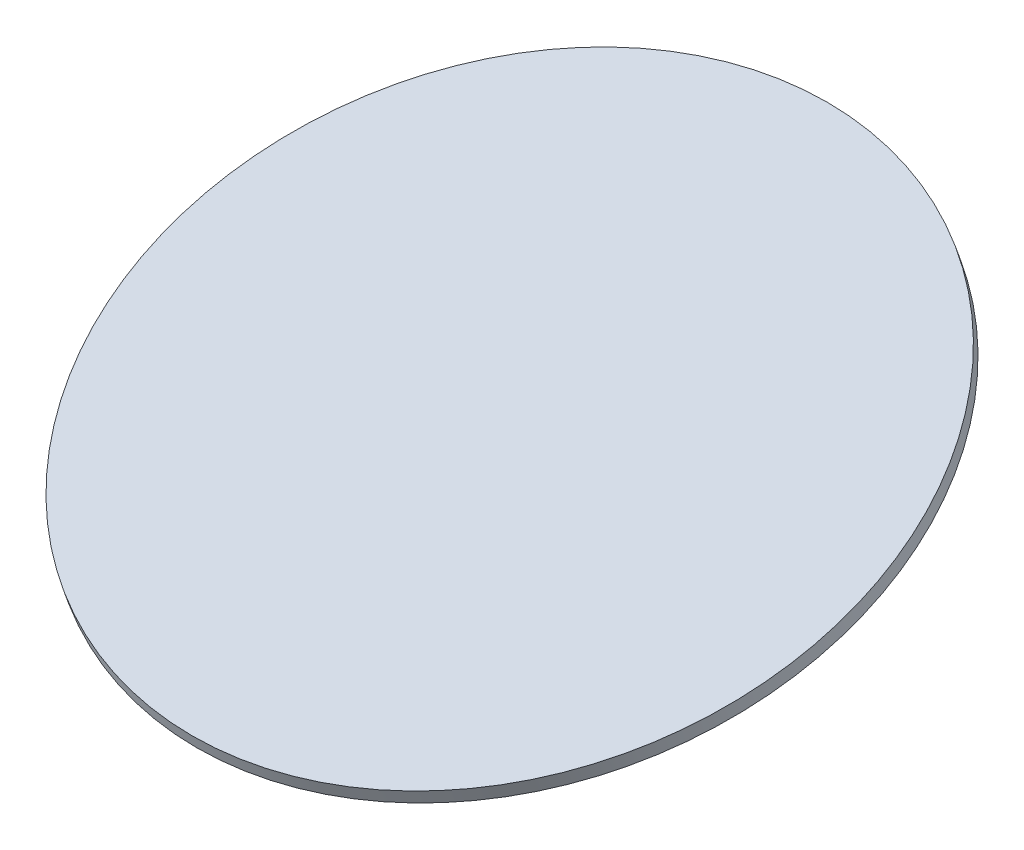
ISO-10303-21;
HEADER;
FILE_DESCRIPTION(('STEP AP214'),'2;1');
FILE_NAME('part.step','',(''),(''),'','','');
FILE_SCHEMA(('AUTOMOTIVE_DESIGN { 1 0 10303 214 1 1 1 1 }'));
ENDSEC;
DATA;
#1=APPLICATION_CONTEXT('core data for automotive mechanical design processes');
#2=APPLICATION_PROTOCOL_DEFINITION('international standard','automotive_design',2000,#1);
#3=PRODUCT_CONTEXT('',#1,'mechanical');
#4=PRODUCT('Part','Part','',(#3));
#5=PRODUCT_RELATED_PRODUCT_CATEGORY('part','',(#4));
#6=PRODUCT_DEFINITION_FORMATION('','',#4);
#7=PRODUCT_DEFINITION_CONTEXT('part definition',#1,'design');
#8=PRODUCT_DEFINITION('design','',#6,#7);
#9=PRODUCT_DEFINITION_SHAPE('','',#8);
#10=(LENGTH_UNIT() NAMED_UNIT(*) SI_UNIT(.MILLI.,.METRE.));
#11=(NAMED_UNIT(*) PLANE_ANGLE_UNIT() SI_UNIT($,.RADIAN.));
#12=(NAMED_UNIT(*) SI_UNIT($,.STERADIAN.) SOLID_ANGLE_UNIT());
#13=UNCERTAINTY_MEASURE_WITH_UNIT(LENGTH_MEASURE(1.E-05),#10,'distance_accuracy_value','');
#14=(GEOMETRIC_REPRESENTATION_CONTEXT(3) GLOBAL_UNCERTAINTY_ASSIGNED_CONTEXT((#13)) GLOBAL_UNIT_ASSIGNED_CONTEXT((#10,
#11,#12)) REPRESENTATION_CONTEXT('',''));
#15=CARTESIAN_POINT('',(0.,0.,0.));
#16=DIRECTION('',(0.,0.,1.));
#17=DIRECTION('',(1.,0.,0.));
#18=AXIS2_PLACEMENT_3D('',#15,#16,#17);
#19=CARTESIAN_POINT('',(0.,5580.348810718,-727.370676584469));
#20=DIRECTION('',(0.,-0.939692620785908,-0.34202014332567));
#21=DIRECTION('',(0.,0.34202014332567,-0.939692620785908));
#22=AXIS2_PLACEMENT_3D('',#19,#20,#21);
#23=PLANE('',#22);
#24=CARTESIAN_POINT('',(-7.0853130932468E-13,5622.82605776482,-844.075953686204));
#25=DIRECTION('',(0.,-0.939692620786001,-0.342020143325415));
#26=DIRECTION('',(0.,0.342020143325415,-0.939692620786001));
#27=AXIS2_PLACEMENT_3D('',#24,#25,#26);
#28=CIRCLE('',#27,60.7799812854455);
#29=CARTESIAN_POINT('',(-7.0853130932468E-13,5643.61403567538,-901.190453591648));
#30=VERTEX_POINT('',#29);
#31=EDGE_CURVE('E18',#30,#30,#28,.F.);
#32=ORIENTED_EDGE('',*,*,#31,.F.);
#33=EDGE_LOOP('',(#32));
#34=FACE_BOUND('',#33,.T.);
#35=ADVANCED_FACE('F14',(#34),#23,.T.);
#36=CARTESIAN_POINT('',(-6.32383034826489E-13,5625.11063776103,-843.244434569783));
#37=DIRECTION('',(0.,-0.939692620786001,-0.342020143325415));
#38=DIRECTION('',(0.,0.342020143325415,-0.939692620786001));
#39=AXIS2_PLACEMENT_3D('',#36,#37,#38);
#40=CYLINDRICAL_SURFACE('',#39,60.7799812854455);
#41=ORIENTED_EDGE('',*,*,#31,.T.);
#42=EDGE_LOOP('',(#41));
#43=FACE_BOUND('',#42,.T.);
#44=CARTESIAN_POINT('',(-1.58451030074628E-12,5625.11063776104,-843.244434569779));
#45=DIRECTION('',(0.,-0.939692620786129,-0.342020143325062));
#46=DIRECTION('',(0.,0.342020143325062,-0.939692620786129));
#47=AXIS2_PLACEMENT_3D('',#44,#45,#46);
#48=CIRCLE('',#47,60.7799812854449);
#49=CARTESIAN_POINT('',(-1.58451030074628E-12,5645.89861567159,-900.35893447523));
#50=VERTEX_POINT('',#49);
#51=EDGE_CURVE('E9',#50,#50,#48,.F.);
#52=ORIENTED_EDGE('',*,*,#51,.F.);
#53=EDGE_LOOP('',(#52));
#54=FACE_BOUND('',#53,.T.);
#55=ADVANCED_FACE('F27',(#43,#54),#40,.T.);
#56=CARTESIAN_POINT('',(-124.195161822308,5625.11063776104,-843.244434569781));
#57=DIRECTION('',(0.,0.939692620785908,0.34202014332567));
#58=DIRECTION('',(0.,-0.34202014332567,0.939692620785908));
#59=AXIS2_PLACEMENT_3D('',#56,#57,#58);
#60=PLANE('',#59);
#61=ORIENTED_EDGE('',*,*,#51,.T.);
#62=EDGE_LOOP('',(#61));
#63=FACE_BOUND('',#62,.T.);
#64=ADVANCED_FACE('F16',(#63),#60,.T.);
#65=CLOSED_SHELL('',(#35,#55,#64));
#66=MANIFOLD_SOLID_BREP('B1',#65);
#67=ADVANCED_BREP_SHAPE_REPRESENTATION('',(#18,#66),#14);
#68=SHAPE_DEFINITION_REPRESENTATION(#9,#67);
ENDSEC;
END-ISO-10303-21;
